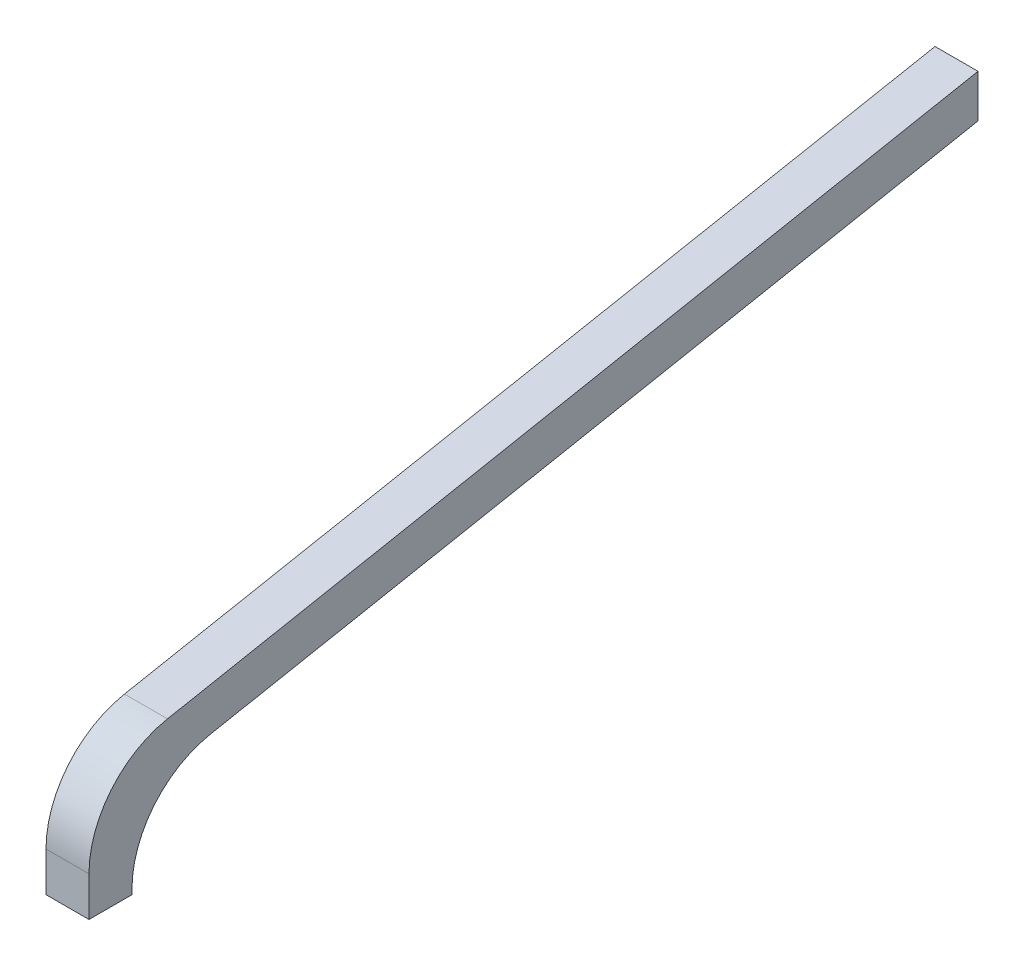
ISO-10303-21;
HEADER;
FILE_DESCRIPTION(('STEP AP214'),'2;1');
FILE_NAME('part.step','',(''),(''),'','','');
FILE_SCHEMA(('AUTOMOTIVE_DESIGN { 1 0 10303 214 1 1 1 1 }'));
ENDSEC;
DATA;
#1=APPLICATION_CONTEXT('core data for automotive mechanical design processes');
#2=APPLICATION_PROTOCOL_DEFINITION('international standard','automotive_design',2000,#1);
#3=PRODUCT_CONTEXT('',#1,'mechanical');
#4=PRODUCT('Part','Part','',(#3));
#5=PRODUCT_RELATED_PRODUCT_CATEGORY('part','',(#4));
#6=PRODUCT_DEFINITION_FORMATION('','',#4);
#7=PRODUCT_DEFINITION_CONTEXT('part definition',#1,'design');
#8=PRODUCT_DEFINITION('design','',#6,#7);
#9=PRODUCT_DEFINITION_SHAPE('','',#8);
#10=(LENGTH_UNIT() NAMED_UNIT(*) SI_UNIT(.MILLI.,.METRE.));
#11=(NAMED_UNIT(*) PLANE_ANGLE_UNIT() SI_UNIT($,.RADIAN.));
#12=(NAMED_UNIT(*) SI_UNIT($,.STERADIAN.) SOLID_ANGLE_UNIT());
#13=UNCERTAINTY_MEASURE_WITH_UNIT(LENGTH_MEASURE(1.E-05),#10,'distance_accuracy_value','');
#14=(GEOMETRIC_REPRESENTATION_CONTEXT(3) GLOBAL_UNCERTAINTY_ASSIGNED_CONTEXT((#13)) GLOBAL_UNIT_ASSIGNED_CONTEXT((#10,
#11,#12)) REPRESENTATION_CONTEXT('',''));
#15=CARTESIAN_POINT('',(0.,0.,0.));
#16=DIRECTION('',(0.,0.,1.));
#17=DIRECTION('',(1.,0.,0.));
#18=AXIS2_PLACEMENT_3D('',#15,#16,#17);
#19=CARTESIAN_POINT('',(3.33375,-3.01580115473571,-2.8055));
#20=DIRECTION('',(1.,0.,0.));
#21=DIRECTION('',(0.,0.,-1.));
#22=AXIS2_PLACEMENT_3D('',#19,#20,#21);
#23=PLANE('',#22);
#24=DIRECTION('',(0.,-0.18846469104419,0.982079966311104));
#25=VECTOR('',#24,1.);
#26=CARTESIAN_POINT('',(3.33375,-2.3929200336889,-3.06153530895581));
#27=LINE('',#26,#25);
#28=CARTESIAN_POINT('',(3.33375,-0.869500000000001,-11.));
#29=VERTEX_POINT('',#28);
#30=CARTESIAN_POINT('',(3.33375,-2.3929200336889,-3.06153530895581));
#31=VERTEX_POINT('',#30);
#32=EDGE_CURVE('E96',#29,#31,#27,.T.);
#33=ORIENTED_EDGE('',*,*,#32,.T.);
#34=CARTESIAN_POINT('',(3.33375,-3.375,-3.25));
#35=DIRECTION('',(-1.,0.,0.));
#36=DIRECTION('',(0.,0.,1.));
#37=AXIS2_PLACEMENT_3D('',#34,#35,#36);
#38=CIRCLE('',#37,1.);
#39=CARTESIAN_POINT('',(3.33375,-3.375,-2.25));
#40=VERTEX_POINT('',#39);
#41=EDGE_CURVE('E119',#31,#40,#38,.F.);
#42=ORIENTED_EDGE('',*,*,#41,.T.);
#43=DIRECTION('',(0.,1.,0.));
#44=VECTOR('',#43,1.);
#45=CARTESIAN_POINT('',(3.33375,-3.425,-2.25));
#46=LINE('',#45,#44);
#47=CARTESIAN_POINT('',(3.33375,-3.425,-2.25));
#48=VERTEX_POINT('',#47);
#49=EDGE_CURVE('E124',#40,#48,#46,.F.);
#50=ORIENTED_EDGE('',*,*,#49,.T.);
#51=DIRECTION('',(0.,0.,1.));
#52=VECTOR('',#51,1.);
#53=CARTESIAN_POINT('',(3.33375,-3.425,-1.8055));
#54=LINE('',#53,#52);
#55=CARTESIAN_POINT('',(3.33375,-3.425,-1.8055));
#56=VERTEX_POINT('',#55);
#57=EDGE_CURVE('E133',#48,#56,#54,.T.);
#58=ORIENTED_EDGE('',*,*,#57,.T.);
#59=DIRECTION('',(0.,1.,0.));
#60=VECTOR('',#59,1.);
#61=CARTESIAN_POINT('',(3.33375,-3.01580115473571,-1.8055));
#62=LINE('',#61,#60);
#63=CARTESIAN_POINT('',(3.33375,-3.01580115473571,-1.8055));
#64=VERTEX_POINT('',#63);
#65=EDGE_CURVE('E141',#56,#64,#62,.T.);
#66=ORIENTED_EDGE('',*,*,#65,.T.);
#67=CARTESIAN_POINT('',(3.33375,-3.01580115473571,-2.8055));
#68=DIRECTION('',(-1.,0.,0.));
#69=DIRECTION('',(0.,0.,1.));
#70=AXIS2_PLACEMENT_3D('',#67,#68,#69);
#71=CIRCLE('',#70,1.);
#72=CARTESIAN_POINT('',(3.33375,-2.03372118842461,-2.61703530895581));
#73=VERTEX_POINT('',#72);
#74=EDGE_CURVE('E20',#73,#64,#71,.F.);
#75=ORIENTED_EDGE('',*,*,#74,.F.);
#76=DIRECTION('',(0.,0.18846469104419,-0.982079966311104));
#77=VECTOR('',#76,1.);
#78=CARTESIAN_POINT('',(3.33375,-0.425000000000001,-11.));
#79=LINE('',#78,#77);
#80=CARTESIAN_POINT('',(3.33375,-0.425000000000001,-11.));
#81=VERTEX_POINT('',#80);
#82=EDGE_CURVE('E150',#73,#81,#79,.T.);
#83=ORIENTED_EDGE('',*,*,#82,.T.);
#84=DIRECTION('',(0.,1.,0.));
#85=VECTOR('',#84,1.);
#86=CARTESIAN_POINT('',(3.33375,-0.869500000000001,-11.));
#87=LINE('',#86,#85);
#88=EDGE_CURVE('E70',#81,#29,#87,.F.);
#89=ORIENTED_EDGE('',*,*,#88,.T.);
#90=EDGE_LOOP('',(#33,#42,#50,#58,#66,#75,#83,#89));
#91=FACE_BOUND('',#90,.T.);
#92=ADVANCED_FACE('F17',(#91),#23,.F.);
#93=CARTESIAN_POINT('',(3.77825,-0.869500000000001,-11.));
#94=DIRECTION('',(0.,0.,1.));
#95=DIRECTION('',(1.,0.,0.));
#96=AXIS2_PLACEMENT_3D('',#93,#94,#95);
#97=PLANE('',#96);
#98=DIRECTION('',(1.,0.,0.));
#99=VECTOR('',#98,1.);
#100=CARTESIAN_POINT('',(3.77825,-0.425000000000001,-11.));
#101=LINE('',#100,#99);
#102=CARTESIAN_POINT('',(3.77825,-0.425000000000001,-11.));
#103=VERTEX_POINT('',#102);
#104=EDGE_CURVE('E91',#81,#103,#101,.T.);
#105=ORIENTED_EDGE('',*,*,#104,.T.);
#106=DIRECTION('',(0.,1.,0.));
#107=VECTOR('',#106,1.);
#108=CARTESIAN_POINT('',(3.77825,-3.01580115473571,-11.));
#109=LINE('',#108,#107);
#110=CARTESIAN_POINT('',(3.77825,-0.869500000000001,-11.));
#111=VERTEX_POINT('',#110);
#112=EDGE_CURVE('E85',#111,#103,#109,.T.);
#113=ORIENTED_EDGE('',*,*,#112,.F.);
#114=DIRECTION('',(1.,0.,0.));
#115=VECTOR('',#114,1.);
#116=CARTESIAN_POINT('',(3.77825,-0.869500000000001,-11.));
#117=LINE('',#116,#115);
#118=EDGE_CURVE('E88',#111,#29,#117,.F.);
#119=ORIENTED_EDGE('',*,*,#118,.T.);
#120=ORIENTED_EDGE('',*,*,#88,.F.);
#121=EDGE_LOOP('',(#105,#113,#119,#120));
#122=FACE_BOUND('',#121,.T.);
#123=ADVANCED_FACE('F87',(#122),#97,.F.);
#124=CARTESIAN_POINT('',(3.77825,-0.425000000000001,-11.));
#125=DIRECTION('',(0.,-0.982079966311104,-0.18846469104419));
#126=DIRECTION('',(0.,0.18846469104419,-0.982079966311104));
#127=AXIS2_PLACEMENT_3D('',#124,#125,#126);
#128=PLANE('',#127);
#129=DIRECTION('',(-1.,0.,0.));
#130=VECTOR('',#129,1.);
#131=CARTESIAN_POINT('',(3.77825,-2.03372118842461,-2.61703530895581));
#132=LINE('',#131,#130);
#133=CARTESIAN_POINT('',(3.77825,-2.03372118842461,-2.61703530895581));
#134=VERTEX_POINT('',#133);
#135=EDGE_CURVE('E146',#134,#73,#132,.T.);
#136=ORIENTED_EDGE('',*,*,#135,.F.);
#137=DIRECTION('',(0.,-0.18846469104419,0.982079966311103));
#138=VECTOR('',#137,1.);
#139=CARTESIAN_POINT('',(3.77825,-0.425000000000001,-11.));
#140=LINE('',#139,#138);
#141=EDGE_CURVE('E95',#103,#134,#140,.T.);
#142=ORIENTED_EDGE('',*,*,#141,.F.);
#143=ORIENTED_EDGE('',*,*,#104,.F.);
#144=ORIENTED_EDGE('',*,*,#82,.F.);
#145=EDGE_LOOP('',(#136,#142,#143,#144));
#146=FACE_BOUND('',#145,.T.);
#147=ADVANCED_FACE('F190',(#146),#128,.F.);
#148=CARTESIAN_POINT('',(3.77825,-3.01580115473571,-2.8055));
#149=DIRECTION('',(-1.,0.,0.));
#150=DIRECTION('',(0.,0.,1.));
#151=AXIS2_PLACEMENT_3D('',#148,#149,#150);
#152=CYLINDRICAL_SURFACE('',#151,1.);
#153=CARTESIAN_POINT('',(3.77825,-3.01580115473571,-2.8055));
#154=DIRECTION('',(-1.,0.,0.));
#155=DIRECTION('',(0.,0.,1.));
#156=AXIS2_PLACEMENT_3D('',#153,#154,#155);
#157=CIRCLE('',#156,1.);
#158=CARTESIAN_POINT('',(3.77825,-3.01580115473571,-1.8055));
#159=VERTEX_POINT('',#158);
#160=EDGE_CURVE('E116',#134,#159,#157,.F.);
#161=ORIENTED_EDGE('',*,*,#160,.F.);
#162=ORIENTED_EDGE('',*,*,#135,.T.);
#163=ORIENTED_EDGE('',*,*,#74,.T.);
#164=DIRECTION('',(-1.,0.,0.));
#165=VECTOR('',#164,1.);
#166=CARTESIAN_POINT('',(3.77825,-3.01580115473571,-1.8055));
#167=LINE('',#166,#165);
#168=EDGE_CURVE('E144',#64,#159,#167,.F.);
#169=ORIENTED_EDGE('',*,*,#168,.T.);
#170=EDGE_LOOP('',(#161,#162,#163,#169));
#171=FACE_BOUND('',#170,.T.);
#172=ADVANCED_FACE('F169',(#171),#152,.T.);
#173=CARTESIAN_POINT('',(3.77825,-3.01580115473571,-1.8055));
#174=DIRECTION('',(0.,0.,-1.));
#175=DIRECTION('',(-1.,0.,0.));
#176=AXIS2_PLACEMENT_3D('',#173,#174,#175);
#177=PLANE('',#176);
#178=DIRECTION('',(1.,0.,0.));
#179=VECTOR('',#178,1.);
#180=CARTESIAN_POINT('',(3.77825,-3.425,-1.8055));
#181=LINE('',#180,#179);
#182=CARTESIAN_POINT('',(3.77825,-3.425,-1.8055));
#183=VERTEX_POINT('',#182);
#184=EDGE_CURVE('E139',#56,#183,#181,.T.);
#185=ORIENTED_EDGE('',*,*,#184,.T.);
#186=DIRECTION('',(0.,1.,0.));
#187=VECTOR('',#186,1.);
#188=CARTESIAN_POINT('',(3.77825,-3.01580115473571,-1.8055));
#189=LINE('',#188,#187);
#190=EDGE_CURVE('E118',#159,#183,#189,.F.);
#191=ORIENTED_EDGE('',*,*,#190,.F.);
#192=ORIENTED_EDGE('',*,*,#168,.F.);
#193=ORIENTED_EDGE('',*,*,#65,.F.);
#194=EDGE_LOOP('',(#185,#191,#192,#193));
#195=FACE_BOUND('',#194,.T.);
#196=ADVANCED_FACE('F174',(#195),#177,.F.);
#197=CARTESIAN_POINT('',(3.77825,-3.425,-1.8055));
#198=DIRECTION('',(0.,1.,0.));
#199=DIRECTION('',(0.,0.,1.));
#200=AXIS2_PLACEMENT_3D('',#197,#198,#199);
#201=PLANE('',#200);
#202=DIRECTION('',(1.,0.,0.));
#203=VECTOR('',#202,1.);
#204=CARTESIAN_POINT('',(3.77825,-3.425,-2.25));
#205=LINE('',#204,#203);
#206=CARTESIAN_POINT('',(3.77825,-3.425,-2.25));
#207=VERTEX_POINT('',#206);
#208=EDGE_CURVE('E127',#48,#207,#205,.T.);
#209=ORIENTED_EDGE('',*,*,#208,.T.);
#210=DIRECTION('',(0.,0.,-1.));
#211=VECTOR('',#210,1.);
#212=CARTESIAN_POINT('',(3.77825,-3.425,-2.8055));
#213=LINE('',#212,#211);
#214=EDGE_CURVE('E110',#183,#207,#213,.T.);
#215=ORIENTED_EDGE('',*,*,#214,.F.);
#216=ORIENTED_EDGE('',*,*,#184,.F.);
#217=ORIENTED_EDGE('',*,*,#57,.F.);
#218=EDGE_LOOP('',(#209,#215,#216,#217));
#219=FACE_BOUND('',#218,.T.);
#220=ADVANCED_FACE('F212',(#219),#201,.F.);
#221=CARTESIAN_POINT('',(3.77825,-3.425,-2.25));
#222=DIRECTION('',(0.,0.,1.));
#223=DIRECTION('',(1.,0.,0.));
#224=AXIS2_PLACEMENT_3D('',#221,#222,#223);
#225=PLANE('',#224);
#226=DIRECTION('',(-1.,0.,0.));
#227=VECTOR('',#226,1.);
#228=CARTESIAN_POINT('',(3.77825,-3.375,-2.25));
#229=LINE('',#228,#227);
#230=CARTESIAN_POINT('',(3.77825,-3.375,-2.25));
#231=VERTEX_POINT('',#230);
#232=EDGE_CURVE('E121',#40,#231,#229,.F.);
#233=ORIENTED_EDGE('',*,*,#232,.T.);
#234=DIRECTION('',(0.,1.,0.));
#235=VECTOR('',#234,1.);
#236=CARTESIAN_POINT('',(3.77825,-3.01580115473571,-2.25));
#237=LINE('',#236,#235);
#238=EDGE_CURVE('E107',#207,#231,#237,.T.);
#239=ORIENTED_EDGE('',*,*,#238,.F.);
#240=ORIENTED_EDGE('',*,*,#208,.F.);
#241=ORIENTED_EDGE('',*,*,#49,.F.);
#242=EDGE_LOOP('',(#233,#239,#240,#241));
#243=FACE_BOUND('',#242,.T.);
#244=ADVANCED_FACE('F209',(#243),#225,.F.);
#245=CARTESIAN_POINT('',(3.77825,-3.375,-3.25));
#246=DIRECTION('',(-1.,0.,0.));
#247=DIRECTION('',(0.,0.,1.));
#248=AXIS2_PLACEMENT_3D('',#245,#246,#247);
#249=CYLINDRICAL_SURFACE('',#248,1.);
#250=DIRECTION('',(1.,0.,0.));
#251=VECTOR('',#250,1.);
#252=CARTESIAN_POINT('',(3.77825,-2.3929200336889,-3.06153530895581));
#253=LINE('',#252,#251);
#254=CARTESIAN_POINT('',(3.77825,-2.3929200336889,-3.06153530895581));
#255=VERTEX_POINT('',#254);
#256=EDGE_CURVE('E35',#31,#255,#253,.T.);
#257=ORIENTED_EDGE('',*,*,#256,.T.);
#258=CARTESIAN_POINT('',(3.77825,-3.375,-3.25));
#259=DIRECTION('',(-1.,0.,0.));
#260=DIRECTION('',(0.,0.,1.));
#261=AXIS2_PLACEMENT_3D('',#258,#259,#260);
#262=CIRCLE('',#261,1.);
#263=EDGE_CURVE('E26',#231,#255,#262,.T.);
#264=ORIENTED_EDGE('',*,*,#263,.F.);
#265=ORIENTED_EDGE('',*,*,#232,.F.);
#266=ORIENTED_EDGE('',*,*,#41,.F.);
#267=EDGE_LOOP('',(#257,#264,#265,#266));
#268=FACE_BOUND('',#267,.T.);
#269=ADVANCED_FACE('F204',(#268),#249,.F.);
#270=CARTESIAN_POINT('',(3.77825,-2.3929200336889,-3.06153530895581));
#271=DIRECTION('',(0.,0.982079966311104,0.18846469104419));
#272=DIRECTION('',(0.,-0.18846469104419,0.982079966311104));
#273=AXIS2_PLACEMENT_3D('',#270,#271,#272);
#274=PLANE('',#273);
#275=ORIENTED_EDGE('',*,*,#118,.F.);
#276=DIRECTION('',(0.,0.18846469104419,-0.982079966311103));
#277=VECTOR('',#276,1.);
#278=CARTESIAN_POINT('',(3.77825,-2.3929200336889,-3.06153530895581));
#279=LINE('',#278,#277);
#280=EDGE_CURVE('E11',#255,#111,#279,.T.);
#281=ORIENTED_EDGE('',*,*,#280,.F.);
#282=ORIENTED_EDGE('',*,*,#256,.F.);
#283=ORIENTED_EDGE('',*,*,#32,.F.);
#284=EDGE_LOOP('',(#275,#281,#282,#283));
#285=FACE_BOUND('',#284,.T.);
#286=ADVANCED_FACE('F99',(#285),#274,.F.);
#287=CARTESIAN_POINT('',(3.77825,-3.01580115473571,-2.8055));
#288=DIRECTION('',(1.,0.,0.));
#289=DIRECTION('',(0.,0.,-1.));
#290=AXIS2_PLACEMENT_3D('',#287,#288,#289);
#291=PLANE('',#290);
#292=ORIENTED_EDGE('',*,*,#263,.T.);
#293=ORIENTED_EDGE('',*,*,#280,.T.);
#294=ORIENTED_EDGE('',*,*,#112,.T.);
#295=ORIENTED_EDGE('',*,*,#141,.T.);
#296=ORIENTED_EDGE('',*,*,#160,.T.);
#297=ORIENTED_EDGE('',*,*,#190,.T.);
#298=ORIENTED_EDGE('',*,*,#214,.T.);
#299=ORIENTED_EDGE('',*,*,#238,.T.);
#300=EDGE_LOOP('',(#292,#293,#294,#295,#296,#297,#298,#299));
#301=FACE_BOUND('',#300,.T.);
#302=ADVANCED_FACE('F103',(#301),#291,.T.);
#303=CLOSED_SHELL('',(#92,#123,#147,#172,#196,#220,#244,#269,#286,#302));
#304=MANIFOLD_SOLID_BREP('B1',#303);
#305=ADVANCED_BREP_SHAPE_REPRESENTATION('',(#18,#304),#14);
#306=SHAPE_DEFINITION_REPRESENTATION(#9,#305);
ENDSEC;
END-ISO-10303-21;
